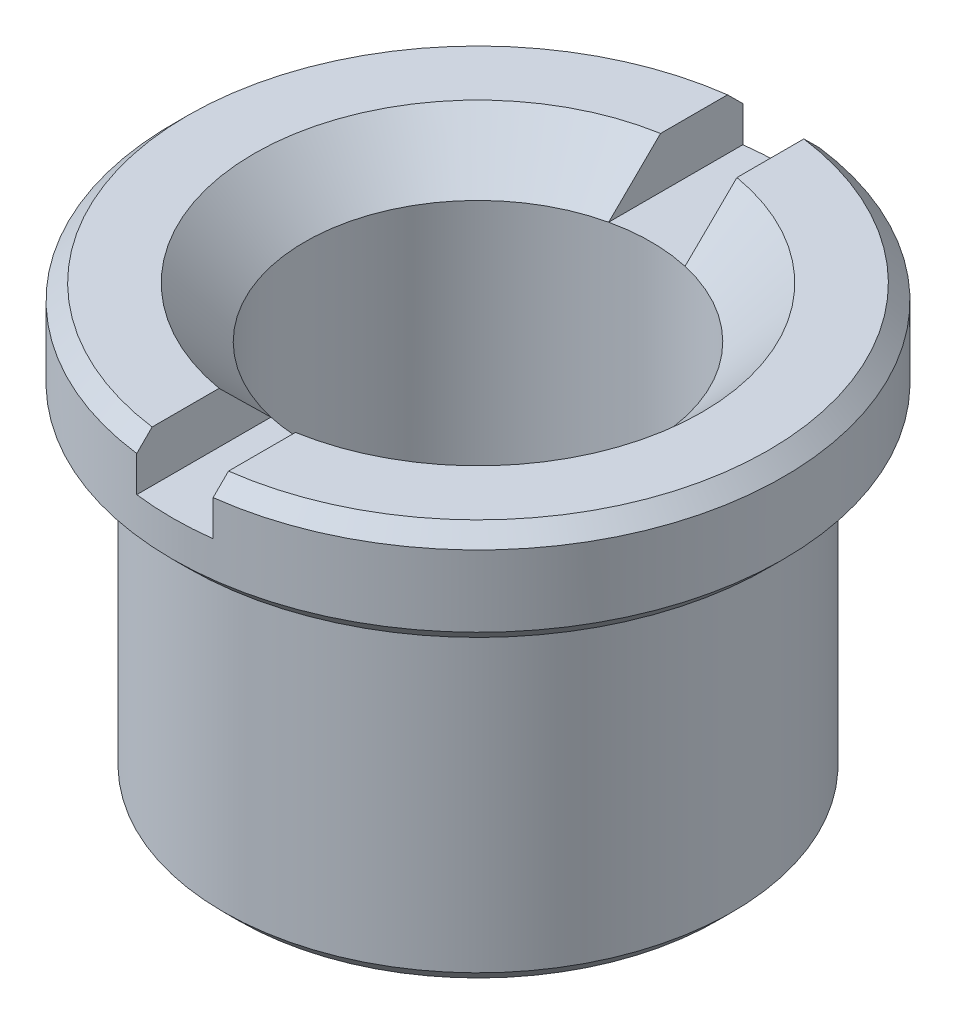
ISO-10303-21;
HEADER;
FILE_DESCRIPTION(('STEP AP214'),'2;1');
FILE_NAME('part.step','',(''),(''),'','','');
FILE_SCHEMA(('AUTOMOTIVE_DESIGN { 1 0 10303 214 1 1 1 1 }'));
ENDSEC;
DATA;
#1=APPLICATION_CONTEXT('core data for automotive mechanical design processes');
#2=APPLICATION_PROTOCOL_DEFINITION('international standard','automotive_design',2000,#1);
#3=PRODUCT_CONTEXT('',#1,'mechanical');
#4=PRODUCT('Part','Part','',(#3));
#5=PRODUCT_RELATED_PRODUCT_CATEGORY('part','',(#4));
#6=PRODUCT_DEFINITION_FORMATION('','',#4);
#7=PRODUCT_DEFINITION_CONTEXT('part definition',#1,'design');
#8=PRODUCT_DEFINITION('design','',#6,#7);
#9=PRODUCT_DEFINITION_SHAPE('','',#8);
#10=(LENGTH_UNIT() NAMED_UNIT(*) SI_UNIT(.MILLI.,.METRE.));
#11=(NAMED_UNIT(*) PLANE_ANGLE_UNIT() SI_UNIT($,.RADIAN.));
#12=(NAMED_UNIT(*) SI_UNIT($,.STERADIAN.) SOLID_ANGLE_UNIT());
#13=UNCERTAINTY_MEASURE_WITH_UNIT(LENGTH_MEASURE(1.E-05),#10,'distance_accuracy_value','');
#14=(GEOMETRIC_REPRESENTATION_CONTEXT(3) GLOBAL_UNCERTAINTY_ASSIGNED_CONTEXT((#13)) GLOBAL_UNIT_ASSIGNED_CONTEXT((#10,
#11,#12)) REPRESENTATION_CONTEXT('',''));
#15=CARTESIAN_POINT('',(0.,0.,0.));
#16=DIRECTION('',(0.,0.,1.));
#17=DIRECTION('',(1.,0.,0.));
#18=AXIS2_PLACEMENT_3D('',#15,#16,#17);
#19=CARTESIAN_POINT('',(0.,2.,0.));
#20=DIRECTION('',(0.,1.,0.));
#21=DIRECTION('',(0.,0.,1.));
#22=AXIS2_PLACEMENT_3D('',#19,#20,#21);
#23=PLANE('',#22);
#24=DIRECTION('',(0.,0.,1.));
#25=VECTOR('',#24,1.);
#26=CARTESIAN_POINT('',(-0.75,2.,-6.));
#27=LINE('',#26,#25);
#28=CARTESIAN_POINT('',(-0.75,2.,-5.65044246055121));
#29=VERTEX_POINT('',#28);
#30=CARTESIAN_POINT('',(-0.75,2.,-4.33560837714847));
#31=VERTEX_POINT('',#30);
#32=EDGE_CURVE('E110',#29,#31,#27,.T.);
#33=ORIENTED_EDGE('',*,*,#32,.F.);
#34=CARTESIAN_POINT('',(0.,2.,0.));
#35=DIRECTION('',(0.,1.,0.));
#36=DIRECTION('',(0.,0.,1.));
#37=AXIS2_PLACEMENT_3D('',#34,#35,#36);
#38=CIRCLE('',#37,5.7);
#39=CARTESIAN_POINT('',(-0.75,2.,5.65044246055121));
#40=VERTEX_POINT('',#39);
#41=EDGE_CURVE('E125',#29,#40,#38,.T.);
#42=ORIENTED_EDGE('',*,*,#41,.T.);
#43=CARTESIAN_POINT('',(-0.75,2.,4.33560837714847));
#44=VERTEX_POINT('',#43);
#45=EDGE_CURVE('E129',#44,#40,#27,.T.);
#46=ORIENTED_EDGE('',*,*,#45,.F.);
#47=CARTESIAN_POINT('',(0.,2.,0.));
#48=DIRECTION('',(0.,1.,0.));
#49=DIRECTION('',(0.,0.,1.));
#50=AXIS2_PLACEMENT_3D('',#47,#48,#49);
#51=CIRCLE('',#50,4.4);
#52=EDGE_CURVE('E127',#44,#31,#51,.F.);
#53=ORIENTED_EDGE('',*,*,#52,.T.);
#54=EDGE_LOOP('',(#33,#42,#46,#53));
#55=FACE_BOUND('',#54,.T.);
#56=ADVANCED_FACE('F27',(#55),#23,.T.);
#57=CARTESIAN_POINT('',(0.,2.,0.));
#58=DIRECTION('',(0.,-1.,0.));
#59=DIRECTION('',(0.,0.,-1.));
#60=AXIS2_PLACEMENT_3D('',#57,#58,#59);
#61=CONICAL_SURFACE('',#60,5.7,0.785398163397451);
#62=CARTESIAN_POINT('',(-0.75,-5.50244964854732,-13.1811295692907));
#63=CARTESIAN_POINT('',(-0.75,-5.05478099603807,-12.7327313731755));
#64=CARTESIAN_POINT('',(-0.75,-4.60714409303798,-12.2843014642933));
#65=CARTESIAN_POINT('',(-0.75,-3.71196849328966,-11.387333500033));
#66=CARTESIAN_POINT('',(-0.75,-3.26442979771123,-10.9387954434876));
#67=CARTESIAN_POINT('',(-0.75,-2.36938194953967,-10.0414628156028));
#68=CARTESIAN_POINT('',(-0.75,-1.92187283324184,-9.59266820805576));
#69=CARTESIAN_POINT('',(-0.75,-1.02707689018501,-8.69486732721045));
#70=CARTESIAN_POINT('',(-0.75,-0.579790061024504,-8.24586105630577));
#71=CARTESIAN_POINT('',(-0.75,0.329658008484288,-7.33222093540016));
#72=CARTESIAN_POINT('',(-0.75,0.791807404006417,-6.86757528928316));
#73=CARTESIAN_POINT('',(-0.75,1.48453964001207,-6.17010224269877));
#74=CARTESIAN_POINT('',(-0.75,1.71537239783538,-5.93752310340704));
#75=CARTESIAN_POINT('',(-0.75,2.17679782047077,-5.47212834983293));
#76=CARTESIAN_POINT('',(-0.75,2.4073904861147,-5.2393127363754));
#77=CARTESIAN_POINT('',(-0.75,2.86818927014462,-4.77337348007483));
#78=CARTESIAN_POINT('',(-0.75,3.09839544498113,-4.54024989309694));
#79=CARTESIAN_POINT('',(-0.75,3.5582637599181,-4.07346058842885));
#80=CARTESIAN_POINT('',(-0.75,3.78792589273961,-3.83979486356706));
#81=CARTESIAN_POINT('',(-0.75,4.24633495136073,-3.37159288807105));
#82=CARTESIAN_POINT('',(-0.75,4.47508193212782,-3.13705669140274));
#83=CARTESIAN_POINT('',(-0.75,4.81689778353833,-2.78399344817121));
#84=CARTESIAN_POINT('',(-0.75,4.93061774527401,-2.66609715333381));
#85=CARTESIAN_POINT('',(-0.75,5.15741329023978,-2.42968681771919));
#86=CARTESIAN_POINT('',(-0.75,5.27048887857206,-2.31117278184757));
#87=CARTESIAN_POINT('',(-0.75,5.44364394360854,-2.12816030567288));
#88=CARTESIAN_POINT('',(-0.75,5.50407755615055,-2.06399712438063));
#89=CARTESIAN_POINT('',(-0.75,5.62456576826783,-1.93531379791633));
#90=CARTESIAN_POINT('',(-0.75,5.68462036202633,-1.87079364729427));
#91=CARTESIAN_POINT('',(-0.75,5.80402507372989,-1.74150403077279));
#92=CARTESIAN_POINT('',(-0.75,5.86337687933406,-1.67673612783531));
#93=CARTESIAN_POINT('',(-0.75,5.98138390364942,-1.54657364497957));
#94=CARTESIAN_POINT('',(-0.75,6.04003914670838,-1.48117908711073));
#95=CARTESIAN_POINT('',(-0.75,6.1761134397731,-1.3272033928619));
#96=CARTESIAN_POINT('',(-0.75,6.25314995326746,-1.23827998150208));
#97=CARTESIAN_POINT('',(-0.75,6.36664876900508,-1.1026914349059));
#98=CARTESIAN_POINT('',(-0.75,6.40425183220425,-1.05698357801538));
#99=CARTESIAN_POINT('',(-0.75,6.47837022018406,-0.964696844545179));
#100=CARTESIAN_POINT('',(-0.75,6.51488565210235,-0.918118054497861));
#101=CARTESIAN_POINT('',(-0.75,6.58681191747285,-0.823201636601465));
#102=CARTESIAN_POINT('',(-0.75,6.62220363056075,-0.77484941908194));
#103=CARTESIAN_POINT('',(-0.75,6.69066088969282,-0.676403323976013));
#104=CARTESIAN_POINT('',(-0.75,6.72372328743947,-0.626307220917132));
#105=CARTESIAN_POINT('',(-0.75,6.78583248337601,-0.524248881303722));
#106=CARTESIAN_POINT('',(-0.75,6.81491178651741,-0.472306728999285));
#107=CARTESIAN_POINT('',(-0.75,6.86698666113133,-0.365471898446387));
#108=CARTESIAN_POINT('',(-0.75,6.89000074816631,-0.310588830215326));
#109=CARTESIAN_POINT('',(-0.75,6.91638797204135,-0.22834406786468));
#110=CARTESIAN_POINT('',(-0.75,6.92363826661116,-0.202233644175635));
#111=CARTESIAN_POINT('',(-0.75,6.93568726930603,-0.149444908819306));
#112=CARTESIAN_POINT('',(-0.75,6.94048637300172,-0.122766689506605));
#113=CARTESIAN_POINT('',(-0.75,6.94727925877906,-0.0692041901929379));
#114=CARTESIAN_POINT('',(-0.75,6.94928901716006,-0.0423219779046503));
#115=CARTESIAN_POINT('',(-0.75,6.95039442917427,0.0115037818463652));
#116=CARTESIAN_POINT('',(-0.75,6.94949010007318,0.038447328944745));
#117=CARTESIAN_POINT('',(-0.75,6.94485041146575,0.0919769816684716));
#118=CARTESIAN_POINT('',(-0.75,6.94112619001429,0.118564075802846));
#119=CARTESIAN_POINT('',(-0.75,6.93113147923295,0.171257645700288));
#120=CARTESIAN_POINT('',(-0.75,6.92485984416922,0.197363899668773));
#121=CARTESIAN_POINT('',(-0.75,6.91009668693179,0.249134817488133));
#122=CARTESIAN_POINT('',(-0.75,6.90158945306443,0.274794927936675));
#123=CARTESIAN_POINT('',(-0.75,6.88277651856004,0.325432791594944));
#124=CARTESIAN_POINT('',(-0.75,6.87247107058718,0.350410640098711));
#125=CARTESIAN_POINT('',(-0.75,6.84250623577978,0.417414849194069));
#126=CARTESIAN_POINT('',(-0.75,6.82144209070967,0.45880997928146));
#127=CARTESIAN_POINT('',(-0.75,6.77643280702762,0.540016775210285));
#128=CARTESIAN_POINT('',(-0.75,6.75248456393777,0.579826672256666));
#129=CARTESIAN_POINT('',(-0.75,6.70252892466663,0.658306008575343));
#130=CARTESIAN_POINT('',(-0.75,6.67651500177718,0.696971256490146));
#131=CARTESIAN_POINT('',(-0.75,6.62307063568393,0.77331459776371));
#132=CARTESIAN_POINT('',(-0.75,6.595639844936,0.810992445473507));
#133=CARTESIAN_POINT('',(-0.75,6.5113252810281,0.923559039389708));
#134=CARTESIAN_POINT('',(-0.75,6.45288693864562,0.997279957162442));
#135=CARTESIAN_POINT('',(-0.75,6.36356806981178,1.10633037192553));
#136=CARTESIAN_POINT('',(-0.75,6.33355275338619,1.14238583382482));
#137=CARTESIAN_POINT('',(-0.75,6.27305546466716,1.2141025806181));
#138=CARTESIAN_POINT('',(-0.75,6.24257351116735,1.24976388128767));
#139=CARTESIAN_POINT('',(-0.75,6.15187238586982,1.35478099774583));
#140=CARTESIAN_POINT('',(-0.75,6.09113769346263,1.4236905275111));
#141=CARTESIAN_POINT('',(-0.75,5.96873482962079,1.5606773388526));
#142=CARTESIAN_POINT('',(-0.75,5.90706661541316,1.62875458203444));
#143=CARTESIAN_POINT('',(-0.75,5.72108104478882,1.83212148804844));
#144=CARTESIAN_POINT('',(-0.75,5.59579919555262,1.96652765677281));
#145=CARTESIAN_POINT('',(-0.75,5.34370397257426,2.23419036180162));
#146=CARTESIAN_POINT('',(-0.75,5.2168889481445,2.36744533305057));
#147=CARTESIAN_POINT('',(-0.75,4.96241276770869,2.63312369210276));
#148=CARTESIAN_POINT('',(-0.75,4.83475168144085,2.76554714673527));
#149=CARTESIAN_POINT('',(-0.75,4.58016353193362,3.02852224818685));
#150=CARTESIAN_POINT('',(-0.75,4.45324204746537,3.15907930492086));
#151=CARTESIAN_POINT('',(-0.75,4.19901743950875,3.41982653351871));
#152=CARTESIAN_POINT('',(-0.75,4.07171430802419,3.55001669758304));
#153=CARTESIAN_POINT('',(-0.75,3.68952851535028,3.940064202386));
#154=CARTESIAN_POINT('',(-0.75,3.43424402791632,4.1995276245701));
#155=CARTESIAN_POINT('',(-0.75,2.82205404856637,4.82031523304686));
#156=CARTESIAN_POINT('',(-0.75,2.46486768384276,5.18136210216456));
#157=CARTESIAN_POINT('',(-0.75,1.7498832767895,5.90285172077205));
#158=CARTESIAN_POINT('',(-0.75,1.39208523234926,6.2632944681688));
#159=CARTESIAN_POINT('',(-0.75,0.318010583452083,7.34425057615378));
#160=CARTESIAN_POINT('',(-0.75,-0.398794731642645,8.06423842610395));
#161=CARTESIAN_POINT('',(-0.75,-1.84663177674266,9.51731636992703));
#162=CARTESIAN_POINT('',(-0.75,-2.57767478837864,10.2503952130515));
#163=CARTESIAN_POINT('',(-0.75,-3.67440819526184,11.3496819060554));
#164=CARTESIAN_POINT('',(-0.75,-4.03997335124324,11.716014689488));
#165=CARTESIAN_POINT('',(-0.75,-4.7711679712479,12.4486157471162));
#166=CARTESIAN_POINT('',(-0.75,-5.13679743524245,12.8148840213403));
#167=CARTESIAN_POINT('',(-0.75,-5.50244964854732,13.1811295692907));
#168=B_SPLINE_CURVE_WITH_KNOTS('',3,(#62,#63,#64,#65,#66,#67,#68,#69,#70,#71,#72,#73,#74,#75,
#76,#77,#78,#79,#80,#81,#82,#83,#84,#85,#86,#87,#88,#89,#90,#91,#92,#93,#94,#95,#96,#97,#98,#99,
#100,#101,#102,#103,#104,#105,#106,#107,#108,#109,#110,#111,#112,#113,#114,#115,#116,#117,#118,
#119,#120,#121,#122,#123,#124,#125,#126,#127,#128,#129,#130,#131,#132,#133,#134,#135,#136,#137,
#138,#139,#140,#141,#142,#143,#144,#145,#146,#147,#148,#149,#150,#151,#152,#153,#154,#155,#156,
#157,#158,#159,#160,#161,#162,#163,#164,#165,#166,#167),.UNSPECIFIED.,.F.,.F.,(4,2,2,2,2,2,2,2,
2,2,2,2,2,2,2,2,2,2,2,2,2,2,2,2,2,2,2,2,2,2,2,2,2,2,2,2,2,2,2,2,2,2,2,2,2,2,2,2,2,2,2,2,4),(0.,
1.90084547860147,3.80171248789362,5.70306171010291,7.60438992377443,9.57042578274919,
10.553477722578,11.5365262450559,12.5194158870674,13.5023186060955,14.485161374214,
14.9765721643686,15.4679790580762,15.7324059736449,15.9968369375356,16.2603806313798,
16.523915086002,16.8768221846977,17.0543745604031,17.2319093879914,17.4116287256374,
17.5915864878387,17.7699748647582,17.947812188266,18.0290109534459,18.1101966107096,
18.1909153214253,18.2716335538911,18.3520346166563,18.4324718810026,18.5134903194132,
18.594497383207,18.7336476338826,18.8729490293074,19.0127095551047,19.1525045271461,
19.4346180893042,19.5753600594326,19.7160963760734,19.9916457843968,20.2672078565499,
20.8184066073749,21.3702637818893,21.9220760207033,22.468324030944,23.0145835671898,
24.1065627203406,25.6301862235753,27.1538149946978,30.2017199315128,33.3075943849309,
34.860185213394,36.4127753501467),.UNSPECIFIED.);
#169=CARTESIAN_POINT('',(-0.75,1.7,-5.95294044989533));
#170=VERTEX_POINT('',#169);
#171=EDGE_CURVE('E107',#170,#29,#168,.T.);
#172=ORIENTED_EDGE('',*,*,#171,.F.);
#173=CARTESIAN_POINT('',(0.,1.7,0.));
#174=DIRECTION('',(0.,1.,0.));
#175=DIRECTION('',(0.,0.,1.));
#176=AXIS2_PLACEMENT_3D('',#173,#174,#175);
#177=CIRCLE('',#176,6.);
#178=CARTESIAN_POINT('',(-0.75,1.7,5.95294044989533));
#179=VERTEX_POINT('',#178);
#180=EDGE_CURVE('E210',#179,#170,#177,.F.);
#181=ORIENTED_EDGE('',*,*,#180,.F.);
#182=EDGE_CURVE('E120',#40,#179,#168,.T.);
#183=ORIENTED_EDGE('',*,*,#182,.F.);
#184=ORIENTED_EDGE('',*,*,#41,.F.);
#185=EDGE_LOOP('',(#172,#181,#183,#184));
#186=FACE_BOUND('',#185,.T.);
#187=ADVANCED_FACE('F132',(#186),#61,.T.);
#188=CARTESIAN_POINT('',(0.,1.,0.));
#189=DIRECTION('',(0.,1.,0.));
#190=DIRECTION('',(0.,0.,1.));
#191=AXIS2_PLACEMENT_3D('',#188,#189,#190);
#192=CONICAL_SURFACE('',#191,3.4,0.78539816339745);
#193=CARTESIAN_POINT('',(-0.75,7.31418155811629,-9.68518576714184));
#194=CARTESIAN_POINT('',(-0.75,6.97155120507807,-9.34152059471804));
#195=CARTESIAN_POINT('',(-0.75,6.62896681825056,-8.9978095466223));
#196=CARTESIAN_POINT('',(-0.75,5.94393951410647,-8.31021964328712));
#197=CARTESIAN_POINT('',(-0.75,5.60149660286721,-7.96634078199336));
#198=CARTESIAN_POINT('',(-0.75,4.9165023734065,-7.27803826842209));
#199=CARTESIAN_POINT('',(-0.75,4.57395126298308,-6.93361440929301));
#200=CARTESIAN_POINT('',(-0.75,3.88920082910696,-6.24444324047164));
#201=CARTESIAN_POINT('',(-0.75,3.54700149273134,-5.89969594362112));
#202=CARTESIAN_POINT('',(-0.75,2.87911802829022,-5.22575955734763));
#203=CARTESIAN_POINT('',(-0.75,2.55340868361142,-4.89659548030135));
#204=CARTESIAN_POINT('',(-0.75,2.06550953210956,-4.40215541927506));
#205=CARTESIAN_POINT('',(-0.75,1.90297790593075,-4.23721684280681));
#206=CARTESIAN_POINT('',(-0.75,1.57824232295729,-3.90702090416947));
#207=CARTESIAN_POINT('',(-0.75,1.4160383625947,-3.74176354551029));
#208=CARTESIAN_POINT('',(-0.75,1.09219786973975,-3.41088049840903));
#209=CARTESIAN_POINT('',(-0.75,0.930561063094283,-3.24525507861587));
#210=CARTESIAN_POINT('',(-0.75,0.608017104002373,-2.91328153173079));
#211=CARTESIAN_POINT('',(-0.75,0.447109982694056,-2.74693337437946));
#212=CARTESIAN_POINT('',(-0.75,0.126532258728838,-2.41310838075579));
#213=CARTESIAN_POINT('',(-0.75,-0.0331385863329311,-2.24563177844141));
#214=CARTESIAN_POINT('',(-0.75,-0.270921320999295,-1.9928049852931));
#215=CARTESIAN_POINT('',(-0.75,-0.349892340876593,-1.90826361976474));
#216=CARTESIAN_POINT('',(-0.75,-0.506991098210672,-1.73840173541851));
#217=CARTESIAN_POINT('',(-0.75,-0.585118857963112,-1.65308123731144));
#218=CARTESIAN_POINT('',(-0.75,-0.684143620753548,-1.54329745954497));
#219=CARTESIAN_POINT('',(-0.75,-0.705635356911377,-1.51937049405328));
#220=CARTESIAN_POINT('',(-0.75,-0.748503392063649,-1.47141326798635));
#221=CARTESIAN_POINT('',(-0.75,-0.769879690715016,-1.4473830071045));
#222=CARTESIAN_POINT('',(-0.75,-0.833816365637889,-1.3751135027586));
#223=CARTESIAN_POINT('',(-0.75,-0.876180442494002,-1.32670004768772));
#224=CARTESIAN_POINT('',(-0.75,-0.96053200523357,-1.22889639301444));
#225=CARTESIAN_POINT('',(-0.75,-1.00251412420002,-1.17950155304197));
#226=CARTESIAN_POINT('',(-0.75,-1.08548938034243,-1.07990655361531));
#227=CARTESIAN_POINT('',(-0.75,-1.12648277627604,-1.02970661071758));
#228=CARTESIAN_POINT('',(-0.75,-1.20742454739497,-0.927744083006676));
#229=CARTESIAN_POINT('',(-0.75,-1.24736058970472,-0.875971649004202));
#230=CARTESIAN_POINT('',(-0.75,-1.3250847515619,-0.770843387240625));
#231=CARTESIAN_POINT('',(-0.75,-1.36287354642078,-0.717488065424835));
#232=CARTESIAN_POINT('',(-0.75,-1.43483503513145,-0.608849327790798));
#233=CARTESIAN_POINT('',(-0.75,-1.46902924443842,-0.553580370776663));
#234=CARTESIAN_POINT('',(-0.75,-1.53176226649812,-0.439974449155854));
#235=CARTESIAN_POINT('',(-0.75,-1.56031682141847,-0.381646616620249));
#236=CARTESIAN_POINT('',(-0.75,-1.60194369846146,-0.275912613644716));
#237=CARTESIAN_POINT('',(-0.75,-1.6170971398497,-0.229355700652344));
#238=CARTESIAN_POINT('',(-0.75,-1.63941904113287,-0.134433528841302));
#239=CARTESIAN_POINT('',(-0.75,-1.64662242043071,-0.0860771503673661));
#240=CARTESIAN_POINT('',(-0.75,-1.65029293684065,-0.01302213875132));
#241=CARTESIAN_POINT('',(-0.75,-1.65031121049458,0.0115270842736805));
#242=CARTESIAN_POINT('',(-0.75,-1.64795990560096,0.0605120756417883));
#243=CARTESIAN_POINT('',(-0.75,-1.64559011470989,0.0849478337016328));
#244=CARTESIAN_POINT('',(-0.75,-1.63506913700528,0.157887633800346));
#245=CARTESIAN_POINT('',(-0.75,-1.62350180456563,0.20591453340347));
#246=CARTESIAN_POINT('',(-0.75,-1.59684695499404,0.289446122203697));
#247=CARTESIAN_POINT('',(-0.75,-1.58307145027556,0.32540323635744));
#248=CARTESIAN_POINT('',(-0.75,-1.55246356655594,0.396014587830714));
#249=CARTESIAN_POINT('',(-0.75,-1.53562865544209,0.430667717016844));
#250=CARTESIAN_POINT('',(-0.75,-1.49966788407717,0.498944209539323));
#251=CARTESIAN_POINT('',(-0.75,-1.48053191043099,0.532562146046301));
#252=CARTESIAN_POINT('',(-0.75,-1.44064580448989,0.598796855096126));
#253=CARTESIAN_POINT('',(-0.75,-1.41989638679814,0.631414062040995));
#254=CARTESIAN_POINT('',(-0.75,-1.37292931908989,0.702292263115173));
#255=CARTESIAN_POINT('',(-0.75,-1.34644796952448,0.740377404296641));
#256=CARTESIAN_POINT('',(-0.75,-1.29224517860666,0.815658362302288));
#257=CARTESIAN_POINT('',(-0.75,-1.26452349816025,0.852854005522303));
#258=CARTESIAN_POINT('',(-0.75,-1.17997289957241,0.963457052081584));
#259=CARTESIAN_POINT('',(-0.75,-1.12179402459591,1.03582896778765));
#260=CARTESIAN_POINT('',(-0.75,-1.00322940551157,1.17900726587616));
#261=CARTESIAN_POINT('',(-0.75,-0.94283870961642,1.24980948362837));
#262=CARTESIAN_POINT('',(-0.75,-0.820751061955796,1.39022594745251));
#263=CARTESIAN_POINT('',(-0.75,-0.759054644864492,1.4598406594801));
#264=CARTESIAN_POINT('',(-0.75,-0.634663458104511,1.59838698904644));
#265=CARTESIAN_POINT('',(-0.75,-0.571967143806558,1.66731721397276));
#266=CARTESIAN_POINT('',(-0.75,-0.445937801329165,1.8046048767594));
#267=CARTESIAN_POINT('',(-0.75,-0.382604710309653,1.87296225684375));
#268=CARTESIAN_POINT('',(-0.75,-0.255574107163305,2.00914484611845));
#269=CARTESIAN_POINT('',(-0.75,-0.191877286211573,2.07697070096552));
#270=CARTESIAN_POINT('',(-0.75,-0.0641395729159035,2.21229296367943));
#271=CARTESIAN_POINT('',(-0.75,-9.86923777381623E-05,2.27978938270048));
#272=CARTESIAN_POINT('',(-0.75,0.191274412036621,2.48069959303105));
#273=CARTESIAN_POINT('',(-0.75,0.318992797685136,2.61374539670136));
#274=CARTESIAN_POINT('',(-0.75,0.575084237848828,2.87920583979933));
#275=CARTESIAN_POINT('',(-0.75,0.703457296927266,3.01162047481507));
#276=CARTESIAN_POINT('',(-0.75,1.08923481858419,3.40823897031806));
#277=CARTESIAN_POINT('',(-0.75,1.34729002897615,3.67180950790126));
#278=CARTESIAN_POINT('',(-0.75,1.86443408574158,4.19824279146907));
#279=CARTESIAN_POINT('',(-0.75,2.12352345876617,4.46110501878485));
#280=CARTESIAN_POINT('',(-0.75,2.64222564684537,4.98630499411698));
#281=CARTESIAN_POINT('',(-0.75,2.90183845427356,5.24864274966554));
#282=CARTESIAN_POINT('',(-0.75,3.42083457558628,5.77242141761487));
#283=CARTESIAN_POINT('',(-0.75,3.6802171709239,6.03386304243547));
#284=CARTESIAN_POINT('',(-0.75,4.19920855388469,6.55652363593615));
#285=CARTESIAN_POINT('',(-0.75,4.45881734236423,6.81774260376578));
#286=CARTESIAN_POINT('',(-0.75,5.23780022234517,7.60108937739938));
#287=CARTESIAN_POINT('',(-0.75,5.75740796465206,8.12298480710111));
#288=CARTESIAN_POINT('',(-0.75,6.44993828580422,8.81811297552466));
#289=CARTESIAN_POINT('',(-0.75,6.62271034938703,8.99149575505957));
#290=CARTESIAN_POINT('',(-0.75,6.96837739949367,9.33831899031139));
#291=CARTESIAN_POINT('',(-0.75,7.14127240313935,9.51175942896367));
#292=CARTESIAN_POINT('',(-0.75,7.31418155811629,9.68518576714184));
#293=B_SPLINE_CURVE_WITH_KNOTS('',3,(#193,#194,#195,#196,#197,#198,#199,#200,#201,#202,#203,
#204,#205,#206,#207,#208,#209,#210,#211,#212,#213,#214,#215,#216,#217,#218,#219,#220,#221,#222,
#223,#224,#225,#226,#227,#228,#229,#230,#231,#232,#233,#234,#235,#236,#237,#238,#239,#240,#241,
#242,#243,#244,#245,#246,#247,#248,#249,#250,#251,#252,#253,#254,#255,#256,#257,#258,#259,#260,
#261,#262,#263,#264,#265,#266,#267,#268,#269,#270,#271,#272,#273,#274,#275,#276,#277,#278,#279,
#280,#281,#282,#283,#284,#285,#286,#287,#288,#289,#290,#291,#292),.UNSPECIFIED.,.F.,.F.,(4,2,2,
2,2,2,2,2,2,2,2,2,2,2,2,2,2,2,2,2,2,2,2,2,2,2,2,2,2,2,2,2,2,2,2,2,2,2,2,2,2,2,2,2,2,2,2,2,2,4),
(0.,1.45585435970213,2.9117658347133,4.36906506123498,5.82630868819838,7.21552315090575,
7.91021079121531,8.60489082586432,9.29916865946951,9.99347584658661,10.6876432614356,
11.0347035430886,11.3817546259342,11.4782403081983,11.5747262770564,11.7677164558543,
11.9621842793226,12.1566006441156,12.3527237067715,12.5487847431952,12.7435959798683,
12.9378554993563,13.0842592887847,13.2300174311586,13.3035563021478,13.3771017126925,
13.5245163130759,13.6398826309694,13.7553448701012,13.8713345206009,13.9872730881024,
14.1263981491781,14.2655501454046,14.5440419726334,14.8232007951876,15.1022474371195,
15.3817775873617,15.6613355991048,15.9404732436142,16.2196013704348,16.7728769961601,
17.32615648366,18.4327483663493,19.5400032406023,20.6472420970955,21.7520855932541,
22.8569332906807,25.0663001118458,25.8006065682242,26.5352959009734),.UNSPECIFIED.);
#294=CARTESIAN_POINT('',(-0.75,1.,-3.31624787975809));
#295=VERTEX_POINT('',#294);
#296=EDGE_CURVE('E11',#31,#295,#293,.T.);
#297=ORIENTED_EDGE('',*,*,#296,.F.);
#298=ORIENTED_EDGE('',*,*,#52,.F.);
#299=CARTESIAN_POINT('',(-0.75,1.,3.31624787975809));
#300=VERTEX_POINT('',#299);
#301=EDGE_CURVE('E31',#300,#44,#293,.T.);
#302=ORIENTED_EDGE('',*,*,#301,.F.);
#303=CARTESIAN_POINT('',(0.,1.,0.));
#304=DIRECTION('',(0.,1.,0.));
#305=DIRECTION('',(0.,0.,1.));
#306=AXIS2_PLACEMENT_3D('',#303,#304,#305);
#307=CIRCLE('',#306,3.4);
#308=EDGE_CURVE('E236',#295,#300,#307,.T.);
#309=ORIENTED_EDGE('',*,*,#308,.F.);
#310=EDGE_LOOP('',(#297,#298,#302,#309));
#311=FACE_BOUND('',#310,.T.);
#312=ADVANCED_FACE('F238',(#311),#192,.F.);
#313=CARTESIAN_POINT('',(0.,-6.5,0.));
#314=DIRECTION('',(0.,1.,0.));
#315=DIRECTION('',(0.,0.,1.));
#316=AXIS2_PLACEMENT_3D('',#313,#314,#315);
#317=CYLINDRICAL_SURFACE('',#316,5.);
#318=CARTESIAN_POINT('',(0.,-6.19999999999999,0.));
#319=DIRECTION('',(0.,1.,0.));
#320=DIRECTION('',(0.,0.,1.));
#321=AXIS2_PLACEMENT_3D('',#318,#319,#320);
#322=CIRCLE('',#321,5.);
#323=CARTESIAN_POINT('',(0.,-6.19999999999999,5.));
#324=VERTEX_POINT('',#323);
#325=EDGE_CURVE('E202',#324,#324,#322,.T.);
#326=ORIENTED_EDGE('',*,*,#325,.T.);
#327=EDGE_LOOP('',(#326));
#328=FACE_BOUND('',#327,.T.);
#329=CARTESIAN_POINT('',(0.,0.,0.));
#330=DIRECTION('',(0.,1.,0.));
#331=DIRECTION('',(0.,0.,1.));
#332=AXIS2_PLACEMENT_3D('',#329,#330,#331);
#333=CIRCLE('',#332,5.);
#334=CARTESIAN_POINT('',(0.,0.,5.));
#335=VERTEX_POINT('',#334);
#336=EDGE_CURVE('E199',#335,#335,#333,.T.);
#337=ORIENTED_EDGE('',*,*,#336,.F.);
#338=EDGE_LOOP('',(#337));
#339=FACE_BOUND('',#338,.T.);
#340=ADVANCED_FACE('F29',(#328,#339),#317,.T.);
#341=CARTESIAN_POINT('',(0.,-6.5,0.));
#342=DIRECTION('',(0.,1.,0.));
#343=DIRECTION('',(0.,0.,1.));
#344=AXIS2_PLACEMENT_3D('',#341,#342,#343);
#345=PLANE('',#344);
#346=CARTESIAN_POINT('',(0.,-6.5,0.));
#347=DIRECTION('',(0.,1.,0.));
#348=DIRECTION('',(0.,0.,1.));
#349=AXIS2_PLACEMENT_3D('',#346,#347,#348);
#350=CIRCLE('',#349,4.69999999999999);
#351=CARTESIAN_POINT('',(0.,-6.5,4.69999999999999));
#352=VERTEX_POINT('',#351);
#353=EDGE_CURVE('E205',#352,#352,#350,.F.);
#354=ORIENTED_EDGE('',*,*,#353,.T.);
#355=EDGE_LOOP('',(#354));
#356=FACE_BOUND('',#355,.T.);
#357=CARTESIAN_POINT('',(0.,-6.5,0.));
#358=DIRECTION('',(0.,1.,0.));
#359=DIRECTION('',(0.,0.,1.));
#360=AXIS2_PLACEMENT_3D('',#357,#358,#359);
#361=CIRCLE('',#360,3.4);
#362=CARTESIAN_POINT('',(0.,-6.5,3.4));
#363=VERTEX_POINT('',#362);
#364=EDGE_CURVE('E196',#363,#363,#361,.T.);
#365=ORIENTED_EDGE('',*,*,#364,.T.);
#366=EDGE_LOOP('',(#365));
#367=FACE_BOUND('',#366,.T.);
#368=ADVANCED_FACE('F267',(#356,#367),#345,.F.);
#369=CARTESIAN_POINT('',(0.,2.,0.));
#370=DIRECTION('',(0.,-1.,0.));
#371=DIRECTION('',(0.,0.,-1.));
#372=AXIS2_PLACEMENT_3D('',#369,#370,#371);
#373=CYLINDRICAL_SURFACE('',#372,6.);
#374=ORIENTED_EDGE('',*,*,#180,.T.);
#375=DIRECTION('',(0.,-1.,0.));
#376=VECTOR('',#375,1.);
#377=CARTESIAN_POINT('',(-0.75,2.,-5.95294044989533));
#378=LINE('',#377,#376);
#379=CARTESIAN_POINT('',(-0.75,1.,-5.95294044989533));
#380=VERTEX_POINT('',#379);
#381=EDGE_CURVE('E113',#170,#380,#378,.T.);
#382=ORIENTED_EDGE('',*,*,#381,.T.);
#383=CARTESIAN_POINT('',(0.,1.,0.));
#384=DIRECTION('',(0.,1.,0.));
#385=DIRECTION('',(0.,0.,1.));
#386=AXIS2_PLACEMENT_3D('',#383,#384,#385);
#387=CIRCLE('',#386,6.);
#388=CARTESIAN_POINT('',(0.75,1.,-5.95294044989533));
#389=VERTEX_POINT('',#388);
#390=EDGE_CURVE('E176',#389,#380,#387,.T.);
#391=ORIENTED_EDGE('',*,*,#390,.F.);
#392=DIRECTION('',(0.,-1.,0.));
#393=VECTOR('',#392,1.);
#394=CARTESIAN_POINT('',(0.75,2.,-5.95294044989533));
#395=LINE('',#394,#393);
#396=CARTESIAN_POINT('',(0.75,1.7,-5.95294044989533));
#397=VERTEX_POINT('',#396);
#398=EDGE_CURVE('E175',#389,#397,#395,.F.);
#399=ORIENTED_EDGE('',*,*,#398,.T.);
#400=CARTESIAN_POINT('',(0.75,1.7,5.95294044989533));
#401=VERTEX_POINT('',#400);
#402=EDGE_CURVE('E208',#397,#401,#177,.F.);
#403=ORIENTED_EDGE('',*,*,#402,.T.);
#404=DIRECTION('',(0.,-1.,0.));
#405=VECTOR('',#404,1.);
#406=CARTESIAN_POINT('',(0.75,2.,5.95294044989533));
#407=LINE('',#406,#405);
#408=CARTESIAN_POINT('',(0.75,1.,5.95294044989533));
#409=VERTEX_POINT('',#408);
#410=EDGE_CURVE('E192',#401,#409,#407,.T.);
#411=ORIENTED_EDGE('',*,*,#410,.T.);
#412=CARTESIAN_POINT('',(-0.75,1.,5.95294044989533));
#413=VERTEX_POINT('',#412);
#414=EDGE_CURVE('E219',#413,#409,#387,.T.);
#415=ORIENTED_EDGE('',*,*,#414,.F.);
#416=DIRECTION('',(0.,-1.,0.));
#417=VECTOR('',#416,1.);
#418=CARTESIAN_POINT('',(-0.75,2.,5.95294044989533));
#419=LINE('',#418,#417);
#420=EDGE_CURVE('E118',#413,#179,#419,.F.);
#421=ORIENTED_EDGE('',*,*,#420,.T.);
#422=EDGE_LOOP('',(#374,#382,#391,#399,#403,#411,#415,#421));
#423=FACE_BOUND('',#422,.T.);
#424=CARTESIAN_POINT('',(0.,0.299999999999999,0.));
#425=DIRECTION('',(0.,1.,0.));
#426=DIRECTION('',(0.,0.,1.));
#427=AXIS2_PLACEMENT_3D('',#424,#425,#426);
#428=CIRCLE('',#427,6.);
#429=CARTESIAN_POINT('',(0.,0.299999999999999,6.));
#430=VERTEX_POINT('',#429);
#431=EDGE_CURVE('E139',#430,#430,#428,.T.);
#432=ORIENTED_EDGE('',*,*,#431,.T.);
#433=EDGE_LOOP('',(#432));
#434=FACE_BOUND('',#433,.T.);
#435=ADVANCED_FACE('F215',(#423,#434),#373,.T.);
#436=DIRECTION('',(0.,0.,-1.));
#437=VECTOR('',#436,1.);
#438=CARTESIAN_POINT('',(0.75,2.,-6.));
#439=LINE('',#438,#437);
#440=CARTESIAN_POINT('',(0.75,2.,5.65044246055121));
#441=VERTEX_POINT('',#440);
#442=CARTESIAN_POINT('',(0.75,2.,4.33560837714847));
#443=VERTEX_POINT('',#442);
#444=EDGE_CURVE('E226',#441,#443,#439,.T.);
#445=ORIENTED_EDGE('',*,*,#444,.F.);
#446=CARTESIAN_POINT('',(0.75,2.,-5.65044246055121));
#447=VERTEX_POINT('',#446);
#448=EDGE_CURVE('E133',#441,#447,#38,.T.);
#449=ORIENTED_EDGE('',*,*,#448,.T.);
#450=CARTESIAN_POINT('',(0.75,2.,-4.33560837714847));
#451=VERTEX_POINT('',#450);
#452=EDGE_CURVE('E128',#451,#447,#439,.T.);
#453=ORIENTED_EDGE('',*,*,#452,.F.);
#454=EDGE_CURVE('E146',#451,#443,#51,.F.);
#455=ORIENTED_EDGE('',*,*,#454,.T.);
#456=EDGE_LOOP('',(#445,#449,#453,#455));
#457=FACE_BOUND('',#456,.T.);
#458=ADVANCED_FACE('F252',(#457),#23,.T.);
#459=CARTESIAN_POINT('',(0.,0.,0.));
#460=DIRECTION('',(0.,1.,0.));
#461=DIRECTION('',(0.,0.,1.));
#462=AXIS2_PLACEMENT_3D('',#459,#460,#461);
#463=PLANE('',#462);
#464=CARTESIAN_POINT('',(0.,0.,0.));
#465=DIRECTION('',(0.,1.,0.));
#466=DIRECTION('',(0.,0.,1.));
#467=AXIS2_PLACEMENT_3D('',#464,#465,#466);
#468=CIRCLE('',#467,5.7);
#469=CARTESIAN_POINT('',(0.,0.,5.7));
#470=VERTEX_POINT('',#469);
#471=EDGE_CURVE('E134',#470,#470,#468,.F.);
#472=ORIENTED_EDGE('',*,*,#471,.T.);
#473=EDGE_LOOP('',(#472));
#474=FACE_BOUND('',#473,.T.);
#475=ORIENTED_EDGE('',*,*,#336,.T.);
#476=EDGE_LOOP('',(#475));
#477=FACE_BOUND('',#476,.T.);
#478=ADVANCED_FACE('F258',(#474,#477),#463,.F.);
#479=CARTESIAN_POINT('',(0.,-6.5,0.));
#480=DIRECTION('',(0.,1.,0.));
#481=DIRECTION('',(0.,0.,1.));
#482=AXIS2_PLACEMENT_3D('',#479,#480,#481);
#483=CYLINDRICAL_SURFACE('',#482,3.4);
#484=CARTESIAN_POINT('',(0.75,1.,3.31624787975809));
#485=VERTEX_POINT('',#484);
#486=CARTESIAN_POINT('',(0.75,1.,-3.31624787975809));
#487=VERTEX_POINT('',#486);
#488=EDGE_CURVE('E143',#485,#487,#307,.T.);
#489=ORIENTED_EDGE('',*,*,#488,.T.);
#490=EDGE_CURVE('E147',#487,#295,#307,.T.);
#491=ORIENTED_EDGE('',*,*,#490,.T.);
#492=ORIENTED_EDGE('',*,*,#308,.T.);
#493=EDGE_CURVE('E137',#300,#485,#307,.T.);
#494=ORIENTED_EDGE('',*,*,#493,.T.);
#495=EDGE_LOOP('',(#489,#491,#492,#494));
#496=FACE_BOUND('',#495,.T.);
#497=ORIENTED_EDGE('',*,*,#364,.F.);
#498=EDGE_LOOP('',(#497));
#499=FACE_BOUND('',#498,.T.);
#500=ADVANCED_FACE('F240',(#496,#499),#483,.F.);
#501=CARTESIAN_POINT('',(0.,-6.19999999999999,0.));
#502=DIRECTION('',(0.,1.,0.));
#503=DIRECTION('',(0.,0.,1.));
#504=AXIS2_PLACEMENT_3D('',#501,#502,#503);
#505=CONICAL_SURFACE('',#504,5.,0.785398163397451);
#506=ORIENTED_EDGE('',*,*,#353,.F.);
#507=EDGE_LOOP('',(#506));
#508=FACE_BOUND('',#507,.T.);
#509=ORIENTED_EDGE('',*,*,#325,.F.);
#510=EDGE_LOOP('',(#509));
#511=FACE_BOUND('',#510,.T.);
#512=ADVANCED_FACE('F323',(#508,#511),#505,.T.);
#513=CARTESIAN_POINT('',(0.,0.299999999999999,0.));
#514=DIRECTION('',(0.,1.,0.));
#515=DIRECTION('',(0.,0.,1.));
#516=AXIS2_PLACEMENT_3D('',#513,#514,#515);
#517=CONICAL_SURFACE('',#516,6.,0.78539816339745);
#518=ORIENTED_EDGE('',*,*,#471,.F.);
#519=EDGE_LOOP('',(#518));
#520=FACE_BOUND('',#519,.T.);
#521=ORIENTED_EDGE('',*,*,#431,.F.);
#522=EDGE_LOOP('',(#521));
#523=FACE_BOUND('',#522,.T.);
#524=ADVANCED_FACE('F184',(#520,#523),#517,.T.);
#525=CARTESIAN_POINT('',(0.75,-5.50244964854732,13.1811295692907));
#526=CARTESIAN_POINT('',(0.75,-5.05478099603807,12.7327313731755));
#527=CARTESIAN_POINT('',(0.75,-4.60714409303798,12.2843014642933));
#528=CARTESIAN_POINT('',(0.75,-3.71196849328966,11.387333500033));
#529=CARTESIAN_POINT('',(0.75,-3.26442979771123,10.9387954434876));
#530=CARTESIAN_POINT('',(0.75,-2.36938194953967,10.0414628156028));
#531=CARTESIAN_POINT('',(0.75,-1.92187283324184,9.59266820805576));
#532=CARTESIAN_POINT('',(0.75,-1.02707689018501,8.69486732721045));
#533=CARTESIAN_POINT('',(0.75,-0.579790061024504,8.24586105630577));
#534=CARTESIAN_POINT('',(0.75,0.329658008484288,7.33222093540016));
#535=CARTESIAN_POINT('',(0.75,0.791807404006417,6.86757528928316));
#536=CARTESIAN_POINT('',(0.75,1.48453964001207,6.17010224269877));
#537=CARTESIAN_POINT('',(0.75,1.71537239783538,5.93752310340704));
#538=CARTESIAN_POINT('',(0.75,2.17679782047077,5.47212834983293));
#539=CARTESIAN_POINT('',(0.75,2.4073904861147,5.2393127363754));
#540=CARTESIAN_POINT('',(0.75,2.86818927014462,4.77337348007483));
#541=CARTESIAN_POINT('',(0.75,3.09839544498113,4.54024989309694));
#542=CARTESIAN_POINT('',(0.75,3.5582637599181,4.07346058842885));
#543=CARTESIAN_POINT('',(0.75,3.78792589273961,3.83979486356706));
#544=CARTESIAN_POINT('',(0.75,4.24633495136073,3.37159288807105));
#545=CARTESIAN_POINT('',(0.75,4.47508193212782,3.13705669140274));
#546=CARTESIAN_POINT('',(0.75,4.81689778353833,2.78399344817121));
#547=CARTESIAN_POINT('',(0.75,4.93061774527401,2.66609715333381));
#548=CARTESIAN_POINT('',(0.75,5.15741329023978,2.42968681771919));
#549=CARTESIAN_POINT('',(0.75,5.27048887857206,2.31117278184757));
#550=CARTESIAN_POINT('',(0.75,5.44364394360854,2.12816030567288));
#551=CARTESIAN_POINT('',(0.75,5.50407755615055,2.06399712438063));
#552=CARTESIAN_POINT('',(0.75,5.62456576826783,1.93531379791633));
#553=CARTESIAN_POINT('',(0.75,5.68462036202633,1.87079364729427));
#554=CARTESIAN_POINT('',(0.75,5.80402507372989,1.74150403077279));
#555=CARTESIAN_POINT('',(0.75,5.86337687933406,1.67673612783531));
#556=CARTESIAN_POINT('',(0.75,5.98138390364942,1.54657364497957));
#557=CARTESIAN_POINT('',(0.75,6.04003914670838,1.48117908711073));
#558=CARTESIAN_POINT('',(0.75,6.1761134397731,1.3272033928619));
#559=CARTESIAN_POINT('',(0.75,6.25314995326746,1.23827998150208));
#560=CARTESIAN_POINT('',(0.75,6.36664876900508,1.1026914349059));
#561=CARTESIAN_POINT('',(0.75,6.40425183220425,1.05698357801538));
#562=CARTESIAN_POINT('',(0.75,6.47837022018406,0.964696844545179));
#563=CARTESIAN_POINT('',(0.75,6.51488565210235,0.918118054497861));
#564=CARTESIAN_POINT('',(0.75,6.58681191747285,0.823201636601465));
#565=CARTESIAN_POINT('',(0.75,6.62220363056075,0.77484941908194));
#566=CARTESIAN_POINT('',(0.75,6.69066088969282,0.676403323976013));
#567=CARTESIAN_POINT('',(0.75,6.72372328743947,0.626307220917132));
#568=CARTESIAN_POINT('',(0.75,6.78583248337601,0.524248881303722));
#569=CARTESIAN_POINT('',(0.75,6.81491178651741,0.472306728999285));
#570=CARTESIAN_POINT('',(0.75,6.86698666113133,0.365471898446387));
#571=CARTESIAN_POINT('',(0.75,6.89000074816631,0.310588830215326));
#572=CARTESIAN_POINT('',(0.75,6.91638797204135,0.22834406786468));
#573=CARTESIAN_POINT('',(0.75,6.92363826661116,0.202233644175635));
#574=CARTESIAN_POINT('',(0.75,6.93568726930603,0.149444908819306));
#575=CARTESIAN_POINT('',(0.75,6.94048637300172,0.122766689506605));
#576=CARTESIAN_POINT('',(0.75,6.94727925877906,0.0692041901929379));
#577=CARTESIAN_POINT('',(0.75,6.94928901716006,0.0423219779046503));
#578=CARTESIAN_POINT('',(0.75,6.95039442917427,-0.0115037818463652));
#579=CARTESIAN_POINT('',(0.75,6.94949010007318,-0.038447328944745));
#580=CARTESIAN_POINT('',(0.75,6.94485041146575,-0.0919769816684716));
#581=CARTESIAN_POINT('',(0.75,6.94112619001429,-0.118564075802846));
#582=CARTESIAN_POINT('',(0.75,6.93113147923295,-0.171257645700288));
#583=CARTESIAN_POINT('',(0.75,6.92485984416922,-0.197363899668773));
#584=CARTESIAN_POINT('',(0.75,6.91009668693179,-0.249134817488133));
#585=CARTESIAN_POINT('',(0.75,6.90158945306443,-0.274794927936675));
#586=CARTESIAN_POINT('',(0.75,6.88277651856004,-0.325432791594944));
#587=CARTESIAN_POINT('',(0.75,6.87247107058718,-0.350410640098711));
#588=CARTESIAN_POINT('',(0.75,6.84250623577978,-0.417414849194069));
#589=CARTESIAN_POINT('',(0.75,6.82144209070967,-0.45880997928146));
#590=CARTESIAN_POINT('',(0.75,6.77643280702762,-0.540016775210285));
#591=CARTESIAN_POINT('',(0.75,6.75248456393777,-0.579826672256666));
#592=CARTESIAN_POINT('',(0.75,6.70252892466663,-0.658306008575343));
#593=CARTESIAN_POINT('',(0.75,6.67651500177718,-0.696971256490146));
#594=CARTESIAN_POINT('',(0.75,6.62307063568393,-0.77331459776371));
#595=CARTESIAN_POINT('',(0.75,6.595639844936,-0.810992445473507));
#596=CARTESIAN_POINT('',(0.75,6.5113252810281,-0.923559039389708));
#597=CARTESIAN_POINT('',(0.75,6.45288693864562,-0.997279957162442));
#598=CARTESIAN_POINT('',(0.75,6.36356806981178,-1.10633037192553));
#599=CARTESIAN_POINT('',(0.75,6.33355275338619,-1.14238583382482));
#600=CARTESIAN_POINT('',(0.75,6.27305546466716,-1.2141025806181));
#601=CARTESIAN_POINT('',(0.75,6.24257351116735,-1.24976388128767));
#602=CARTESIAN_POINT('',(0.75,6.15187238586982,-1.35478099774583));
#603=CARTESIAN_POINT('',(0.75,6.09113769346263,-1.4236905275111));
#604=CARTESIAN_POINT('',(0.75,5.96873482962079,-1.5606773388526));
#605=CARTESIAN_POINT('',(0.75,5.90706661541316,-1.62875458203444));
#606=CARTESIAN_POINT('',(0.75,5.72108104478882,-1.83212148804844));
#607=CARTESIAN_POINT('',(0.75,5.59579919555262,-1.96652765677281));
#608=CARTESIAN_POINT('',(0.75,5.34370397257426,-2.23419036180162));
#609=CARTESIAN_POINT('',(0.75,5.2168889481445,-2.36744533305057));
#610=CARTESIAN_POINT('',(0.75,4.96241276770869,-2.63312369210276));
#611=CARTESIAN_POINT('',(0.75,4.83475168144085,-2.76554714673527));
#612=CARTESIAN_POINT('',(0.75,4.58016353193362,-3.02852224818685));
#613=CARTESIAN_POINT('',(0.75,4.45324204746537,-3.15907930492086));
#614=CARTESIAN_POINT('',(0.75,4.19901743950875,-3.41982653351871));
#615=CARTESIAN_POINT('',(0.75,4.07171430802419,-3.55001669758304));
#616=CARTESIAN_POINT('',(0.75,3.68952851535028,-3.940064202386));
#617=CARTESIAN_POINT('',(0.75,3.43424402791632,-4.1995276245701));
#618=CARTESIAN_POINT('',(0.75,2.82205404856637,-4.82031523304686));
#619=CARTESIAN_POINT('',(0.75,2.46486768384276,-5.18136210216456));
#620=CARTESIAN_POINT('',(0.75,1.7498832767895,-5.90285172077205));
#621=CARTESIAN_POINT('',(0.75,1.39208523234926,-6.2632944681688));
#622=CARTESIAN_POINT('',(0.75,0.318010583452083,-7.34425057615378));
#623=CARTESIAN_POINT('',(0.75,-0.398794731642645,-8.06423842610395));
#624=CARTESIAN_POINT('',(0.75,-1.84663177674266,-9.51731636992703));
#625=CARTESIAN_POINT('',(0.75,-2.57767478837864,-10.2503952130515));
#626=CARTESIAN_POINT('',(0.75,-3.67440819526184,-11.3496819060554));
#627=CARTESIAN_POINT('',(0.75,-4.03997335124324,-11.716014689488));
#628=CARTESIAN_POINT('',(0.75,-4.7711679712479,-12.4486157471162));
#629=CARTESIAN_POINT('',(0.75,-5.13679743524245,-12.8148840213403));
#630=CARTESIAN_POINT('',(0.75,-5.50244964854732,-13.1811295692907));
#631=B_SPLINE_CURVE_WITH_KNOTS('',3,(#525,#526,#527,#528,#529,#530,#531,#532,#533,#534,#535,
#536,#537,#538,#539,#540,#541,#542,#543,#544,#545,#546,#547,#548,#549,#550,#551,#552,#553,#554,
#555,#556,#557,#558,#559,#560,#561,#562,#563,#564,#565,#566,#567,#568,#569,#570,#571,#572,#573,
#574,#575,#576,#577,#578,#579,#580,#581,#582,#583,#584,#585,#586,#587,#588,#589,#590,#591,#592,
#593,#594,#595,#596,#597,#598,#599,#600,#601,#602,#603,#604,#605,#606,#607,#608,#609,#610,#611,
#612,#613,#614,#615,#616,#617,#618,#619,#620,#621,#622,#623,#624,#625,#626,#627,#628,#629,#630),
.UNSPECIFIED.,.F.,.F.,(4,2,2,2,2,2,2,2,2,2,2,2,2,2,2,2,2,2,2,2,2,2,2,2,2,2,2,2,2,2,2,2,2,2,2,2,
2,2,2,2,2,2,2,2,2,2,2,2,2,2,2,2,4),(0.,1.90084547860147,3.80171248789362,5.70306171010291,
7.60438992377443,9.57042578274919,10.553477722578,11.5365262450559,12.5194158870674,
13.5023186060955,14.485161374214,14.9765721643686,15.4679790580762,15.7324059736449,
15.9968369375356,16.2603806313798,16.523915086002,16.8768221846977,17.0543745604031,
17.2319093879914,17.4116287256374,17.5915864878387,17.7699748647582,17.947812188266,
18.0290109534459,18.1101966107096,18.1909153214253,18.2716335538911,18.3520346166563,
18.4324718810026,18.5134903194132,18.594497383207,18.7336476338826,18.8729490293074,
19.0127095551047,19.1525045271461,19.4346180893042,19.5753600594326,19.7160963760734,
19.9916457843968,20.2672078565499,20.8184066073749,21.3702637818893,21.9220760207033,
22.468324030944,23.0145835671898,24.1065627203406,25.6301862235753,27.1538149946978,
30.2017199315128,33.3075943849309,34.860185213394,36.4127753501467),.UNSPECIFIED.);
#632=EDGE_CURVE('E177',#401,#441,#631,.T.);
#633=ORIENTED_EDGE('',*,*,#632,.F.);
#634=ORIENTED_EDGE('',*,*,#402,.F.);
#635=EDGE_CURVE('E169',#447,#397,#631,.T.);
#636=ORIENTED_EDGE('',*,*,#635,.F.);
#637=ORIENTED_EDGE('',*,*,#448,.F.);
#638=EDGE_LOOP('',(#633,#634,#636,#637));
#639=FACE_BOUND('',#638,.T.);
#640=ADVANCED_FACE('F180',(#639),#61,.T.);
#641=CARTESIAN_POINT('',(0.75,7.31418155811629,9.68518576714185));
#642=CARTESIAN_POINT('',(0.75,6.97155120507807,9.34152059471804));
#643=CARTESIAN_POINT('',(0.75,6.62896681825057,8.99780954662231));
#644=CARTESIAN_POINT('',(0.75,5.94393951410647,8.31021964328712));
#645=CARTESIAN_POINT('',(0.75,5.60149660286721,7.96634078199336));
#646=CARTESIAN_POINT('',(0.75,4.9165023734065,7.27803826842209));
#647=CARTESIAN_POINT('',(0.75,4.57395126298308,6.93361440929302));
#648=CARTESIAN_POINT('',(0.75,3.88920082910696,6.24444324047164));
#649=CARTESIAN_POINT('',(0.75,3.54700149273134,5.89969594362112));
#650=CARTESIAN_POINT('',(0.75,2.87911802829022,5.22575955734763));
#651=CARTESIAN_POINT('',(0.75,2.55340868361142,4.89659548030135));
#652=CARTESIAN_POINT('',(0.75,2.06550953210956,4.40215541927506));
#653=CARTESIAN_POINT('',(0.75,1.90297790593075,4.23721684280682));
#654=CARTESIAN_POINT('',(0.75,1.57824232295729,3.90702090416947));
#655=CARTESIAN_POINT('',(0.75,1.4160383625947,3.74176354551029));
#656=CARTESIAN_POINT('',(0.75,1.09219786973975,3.41088049840903));
#657=CARTESIAN_POINT('',(0.75,0.930561063094284,3.24525507861587));
#658=CARTESIAN_POINT('',(0.75,0.608017104002374,2.91328153173079));
#659=CARTESIAN_POINT('',(0.75,0.447109982694057,2.74693337437946));
#660=CARTESIAN_POINT('',(0.75,0.126532258728838,2.41310838075579));
#661=CARTESIAN_POINT('',(0.75,-0.0331385863329311,2.24563177844142));
#662=CARTESIAN_POINT('',(0.75,-0.270921320999294,1.9928049852931));
#663=CARTESIAN_POINT('',(0.75,-0.349892340876593,1.90826361976474));
#664=CARTESIAN_POINT('',(0.75,-0.506991098210671,1.73840173541851));
#665=CARTESIAN_POINT('',(0.75,-0.585118857963111,1.65308123731144));
#666=CARTESIAN_POINT('',(0.75,-0.684143620753547,1.54329745954497));
#667=CARTESIAN_POINT('',(0.75,-0.705635356911377,1.51937049405328));
#668=CARTESIAN_POINT('',(0.75,-0.748503392063649,1.47141326798635));
#669=CARTESIAN_POINT('',(0.75,-0.769879690715015,1.4473830071045));
#670=CARTESIAN_POINT('',(0.75,-0.833816365637888,1.3751135027586));
#671=CARTESIAN_POINT('',(0.75,-0.876180442494001,1.32670004768773));
#672=CARTESIAN_POINT('',(0.75,-0.960532005233569,1.22889639301444));
#673=CARTESIAN_POINT('',(0.75,-1.00251412420002,1.17950155304197));
#674=CARTESIAN_POINT('',(0.75,-1.08548938034243,1.07990655361531));
#675=CARTESIAN_POINT('',(0.75,-1.12648277627604,1.02970661071758));
#676=CARTESIAN_POINT('',(0.75,-1.20742454739497,0.927744083006676));
#677=CARTESIAN_POINT('',(0.75,-1.24736058970472,0.875971649004203));
#678=CARTESIAN_POINT('',(0.75,-1.3250847515619,0.770843387240627));
#679=CARTESIAN_POINT('',(0.75,-1.36287354642078,0.717488065424836));
#680=CARTESIAN_POINT('',(0.75,-1.43483503513145,0.608849327790798));
#681=CARTESIAN_POINT('',(0.75,-1.46902924443841,0.553580370776663));
#682=CARTESIAN_POINT('',(0.75,-1.53176226649812,0.439974449155855));
#683=CARTESIAN_POINT('',(0.75,-1.56031682141847,0.38164661662025));
#684=CARTESIAN_POINT('',(0.75,-1.60194369846146,0.275912613644717));
#685=CARTESIAN_POINT('',(0.75,-1.6170971398497,0.229355700652345));
#686=CARTESIAN_POINT('',(0.75,-1.63941904113287,0.134433528841303));
#687=CARTESIAN_POINT('',(0.75,-1.64662242043071,0.0860771503673669));
#688=CARTESIAN_POINT('',(0.75,-1.65029293684065,0.0130221387513208));
#689=CARTESIAN_POINT('',(0.75,-1.65031121049458,-0.0115270842736797));
#690=CARTESIAN_POINT('',(0.75,-1.64795990560096,-0.0605120756417875));
#691=CARTESIAN_POINT('',(0.75,-1.64559011470989,-0.084947833701632));
#692=CARTESIAN_POINT('',(0.75,-1.63506913700528,-0.157887633800346));
#693=CARTESIAN_POINT('',(0.75,-1.62350180456563,-0.205914533403469));
#694=CARTESIAN_POINT('',(0.75,-1.59684695499404,-0.289446122203696));
#695=CARTESIAN_POINT('',(0.75,-1.58307145027556,-0.325403236357439));
#696=CARTESIAN_POINT('',(0.75,-1.55246356655594,-0.396014587830713));
#697=CARTESIAN_POINT('',(0.75,-1.53562865544209,-0.430667717016844));
#698=CARTESIAN_POINT('',(0.75,-1.49966788407717,-0.498944209539322));
#699=CARTESIAN_POINT('',(0.75,-1.480531910431,-0.5325621460463));
#700=CARTESIAN_POINT('',(0.75,-1.44064580448989,-0.598796855096125));
#701=CARTESIAN_POINT('',(0.75,-1.41989638679814,-0.631414062040994));
#702=CARTESIAN_POINT('',(0.75,-1.37292931908989,-0.702292263115172));
#703=CARTESIAN_POINT('',(0.75,-1.34644796952448,-0.740377404296638));
#704=CARTESIAN_POINT('',(0.75,-1.29224517860666,-0.815658362302285));
#705=CARTESIAN_POINT('',(0.75,-1.26452349816026,-0.852854005522299));
#706=CARTESIAN_POINT('',(0.75,-1.17997289957241,-0.96345705208158));
#707=CARTESIAN_POINT('',(0.75,-1.12179402459591,-1.03582896778764));
#708=CARTESIAN_POINT('',(0.75,-1.00322940551157,-1.17900726587615));
#709=CARTESIAN_POINT('',(0.75,-0.942838709616423,-1.24980948362837));
#710=CARTESIAN_POINT('',(0.75,-0.820751061955799,-1.3902259474525));
#711=CARTESIAN_POINT('',(0.75,-0.759054644864496,-1.45984065948009));
#712=CARTESIAN_POINT('',(0.75,-0.634663458104516,-1.59838698904643));
#713=CARTESIAN_POINT('',(0.75,-0.571967143806563,-1.66731721397275));
#714=CARTESIAN_POINT('',(0.75,-0.445937801329171,-1.8046048767594));
#715=CARTESIAN_POINT('',(0.75,-0.382604710309659,-1.87296225684374));
#716=CARTESIAN_POINT('',(0.75,-0.25557410716331,-2.00914484611844));
#717=CARTESIAN_POINT('',(0.75,-0.191877286211577,-2.07697070096551));
#718=CARTESIAN_POINT('',(0.75,-0.0641395729159071,-2.21229296367942));
#719=CARTESIAN_POINT('',(0.75,-9.86923777428515E-05,-2.27978938270048));
#720=CARTESIAN_POINT('',(0.75,0.191274412036615,-2.48069959303104));
#721=CARTESIAN_POINT('',(0.75,0.318992797685131,-2.61374539670136));
#722=CARTESIAN_POINT('',(0.75,0.575084237848822,-2.87920583979932));
#723=CARTESIAN_POINT('',(0.75,0.703457296927258,-3.01162047481506));
#724=CARTESIAN_POINT('',(0.75,1.08923481858418,-3.40823897031805));
#725=CARTESIAN_POINT('',(0.75,1.34729002897614,-3.67180950790125));
#726=CARTESIAN_POINT('',(0.75,1.86443408574156,-4.19824279146906));
#727=CARTESIAN_POINT('',(0.75,2.12352345876615,-4.46110501878484));
#728=CARTESIAN_POINT('',(0.75,2.64222564684536,-4.98630499411697));
#729=CARTESIAN_POINT('',(0.75,2.90183845427354,-5.24864274966553));
#730=CARTESIAN_POINT('',(0.75,3.42083457558626,-5.77242141761485));
#731=CARTESIAN_POINT('',(0.75,3.68021717092388,-6.03386304243545));
#732=CARTESIAN_POINT('',(0.75,4.19920855388467,-6.55652363593613));
#733=CARTESIAN_POINT('',(0.75,4.45881734236421,-6.81774260376576));
#734=CARTESIAN_POINT('',(0.75,5.23780022234515,-7.60108937739935));
#735=CARTESIAN_POINT('',(0.75,5.75740796465203,-8.12298480710109));
#736=CARTESIAN_POINT('',(0.75,6.4499382858042,-8.81811297552464));
#737=CARTESIAN_POINT('',(0.75,6.62271034938702,-8.99149575505955));
#738=CARTESIAN_POINT('',(0.75,6.96837739949366,-9.33831899031138));
#739=CARTESIAN_POINT('',(0.75,7.14127240313935,-9.51175942896366));
#740=CARTESIAN_POINT('',(0.75,7.31418155811629,-9.68518576714185));
#741=B_SPLINE_CURVE_WITH_KNOTS('',3,(#641,#642,#643,#644,#645,#646,#647,#648,#649,#650,#651,
#652,#653,#654,#655,#656,#657,#658,#659,#660,#661,#662,#663,#664,#665,#666,#667,#668,#669,#670,
#671,#672,#673,#674,#675,#676,#677,#678,#679,#680,#681,#682,#683,#684,#685,#686,#687,#688,#689,
#690,#691,#692,#693,#694,#695,#696,#697,#698,#699,#700,#701,#702,#703,#704,#705,#706,#707,#708,
#709,#710,#711,#712,#713,#714,#715,#716,#717,#718,#719,#720,#721,#722,#723,#724,#725,#726,#727,
#728,#729,#730,#731,#732,#733,#734,#735,#736,#737,#738,#739,#740),.UNSPECIFIED.,.F.,.F.,(4,2,2,
2,2,2,2,2,2,2,2,2,2,2,2,2,2,2,2,2,2,2,2,2,2,2,2,2,2,2,2,2,2,2,2,2,2,2,2,2,2,2,2,2,2,2,2,2,2,4),
(0.,1.45585435970213,2.9117658347133,4.36906506123499,5.82630868819838,7.21552315090575,
7.91021079121532,8.60489082586432,9.29916865946952,9.99347584658661,10.6876432614356,
11.0347035430886,11.3817546259342,11.4782403081983,11.5747262770564,11.7677164558543,
11.9621842793226,12.1566006441156,12.3527237067715,12.5487847431952,12.7435959798683,
12.9378554993563,13.0842592887847,13.2300174311586,13.3035563021478,13.3771017126925,
13.5245163130759,13.6398826309694,13.7553448701013,13.8713345206009,13.9872730881024,
14.1263981491781,14.2655501454046,14.5440419726334,14.8232007951876,15.1022474371196,
15.3817775873617,15.6613355991048,15.9404732436143,16.2196013704348,16.7728769961601,
17.32615648366,18.4327483663493,19.5400032406023,20.6472420970955,21.7520855932541,
22.8569332906807,25.0663001118458,25.8006065682241,26.5352959009734),.UNSPECIFIED.);
#742=EDGE_CURVE('E153',#443,#485,#741,.T.);
#743=ORIENTED_EDGE('',*,*,#742,.F.);
#744=ORIENTED_EDGE('',*,*,#454,.F.);
#745=EDGE_CURVE('E148',#487,#451,#741,.T.);
#746=ORIENTED_EDGE('',*,*,#745,.F.);
#747=ORIENTED_EDGE('',*,*,#488,.F.);
#748=EDGE_LOOP('',(#743,#744,#746,#747));
#749=FACE_BOUND('',#748,.T.);
#750=ADVANCED_FACE('F154',(#749),#192,.F.);
#751=CARTESIAN_POINT('',(-0.75,1.,6.));
#752=DIRECTION('',(0.,1.,0.));
#753=DIRECTION('',(0.,0.,1.));
#754=AXIS2_PLACEMENT_3D('',#751,#752,#753);
#755=PLANE('',#754);
#756=ORIENTED_EDGE('',*,*,#414,.T.);
#757=DIRECTION('',(0.,0.,-1.));
#758=VECTOR('',#757,1.);
#759=CARTESIAN_POINT('',(0.75,1.,-6.));
#760=LINE('',#759,#758);
#761=EDGE_CURVE('E54',#409,#485,#760,.T.);
#762=ORIENTED_EDGE('',*,*,#761,.T.);
#763=ORIENTED_EDGE('',*,*,#493,.F.);
#764=DIRECTION('',(0.,0.,1.));
#765=VECTOR('',#764,1.);
#766=CARTESIAN_POINT('',(-0.75,1.,-6.));
#767=LINE('',#766,#765);
#768=EDGE_CURVE('E223',#300,#413,#767,.T.);
#769=ORIENTED_EDGE('',*,*,#768,.T.);
#770=EDGE_LOOP('',(#756,#762,#763,#769));
#771=FACE_BOUND('',#770,.T.);
#772=ADVANCED_FACE('F162',(#771),#755,.T.);
#773=CARTESIAN_POINT('',(0.75,1.,-6.));
#774=DIRECTION('',(1.,0.,0.));
#775=DIRECTION('',(0.,0.,-1.));
#776=AXIS2_PLACEMENT_3D('',#773,#774,#775);
#777=PLANE('',#776);
#778=ORIENTED_EDGE('',*,*,#632,.T.);
#779=ORIENTED_EDGE('',*,*,#444,.T.);
#780=ORIENTED_EDGE('',*,*,#742,.T.);
#781=ORIENTED_EDGE('',*,*,#761,.F.);
#782=ORIENTED_EDGE('',*,*,#410,.F.);
#783=EDGE_LOOP('',(#778,#779,#780,#781,#782));
#784=FACE_BOUND('',#783,.T.);
#785=ADVANCED_FACE('F157',(#784),#777,.F.);
#786=CARTESIAN_POINT('',(-0.75,1.,-6.));
#787=DIRECTION('',(-1.,0.,0.));
#788=DIRECTION('',(0.,0.,1.));
#789=AXIS2_PLACEMENT_3D('',#786,#787,#788);
#790=PLANE('',#789);
#791=ORIENTED_EDGE('',*,*,#768,.F.);
#792=ORIENTED_EDGE('',*,*,#301,.T.);
#793=ORIENTED_EDGE('',*,*,#45,.T.);
#794=ORIENTED_EDGE('',*,*,#182,.T.);
#795=ORIENTED_EDGE('',*,*,#420,.F.);
#796=EDGE_LOOP('',(#791,#792,#793,#794,#795));
#797=FACE_BOUND('',#796,.T.);
#798=ADVANCED_FACE('F161',(#797),#790,.F.);
#799=ORIENTED_EDGE('',*,*,#171,.T.);
#800=ORIENTED_EDGE('',*,*,#32,.T.);
#801=ORIENTED_EDGE('',*,*,#296,.T.);
#802=EDGE_CURVE('E47',#380,#295,#767,.T.);
#803=ORIENTED_EDGE('',*,*,#802,.F.);
#804=ORIENTED_EDGE('',*,*,#381,.F.);
#805=EDGE_LOOP('',(#799,#800,#801,#803,#804));
#806=FACE_BOUND('',#805,.T.);
#807=ADVANCED_FACE('F109',(#806),#790,.F.);
#808=EDGE_CURVE('E228',#487,#389,#760,.T.);
#809=ORIENTED_EDGE('',*,*,#808,.F.);
#810=ORIENTED_EDGE('',*,*,#745,.T.);
#811=ORIENTED_EDGE('',*,*,#452,.T.);
#812=ORIENTED_EDGE('',*,*,#635,.T.);
#813=ORIENTED_EDGE('',*,*,#398,.F.);
#814=EDGE_LOOP('',(#809,#810,#811,#812,#813));
#815=FACE_BOUND('',#814,.T.);
#816=ADVANCED_FACE('F164',(#815),#777,.F.);
#817=ORIENTED_EDGE('',*,*,#390,.T.);
#818=ORIENTED_EDGE('',*,*,#802,.T.);
#819=ORIENTED_EDGE('',*,*,#490,.F.);
#820=ORIENTED_EDGE('',*,*,#808,.T.);
#821=EDGE_LOOP('',(#817,#818,#819,#820));
#822=FACE_BOUND('',#821,.T.);
#823=ADVANCED_FACE('F165',(#822),#755,.T.);
#824=CLOSED_SHELL('',(#56,#187,#312,#340,#368,#435,#458,#478,#500,#512,#524,#640,#750,#772,#785,
#798,#807,#816,#823));
#825=MANIFOLD_SOLID_BREP('B2',#824);
#826=ADVANCED_BREP_SHAPE_REPRESENTATION('',(#18,#825),#14);
#827=SHAPE_DEFINITION_REPRESENTATION(#9,#826);
ENDSEC;
END-ISO-10303-21;
